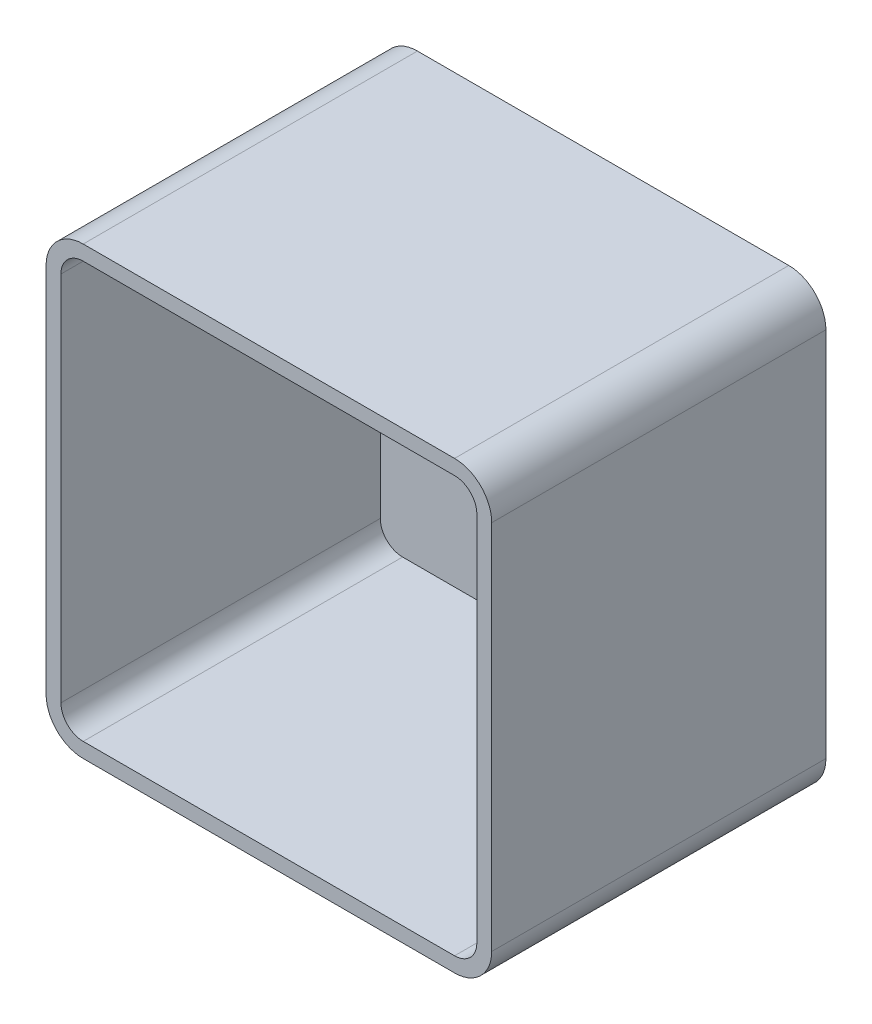
ISO-10303-21;
HEADER;
FILE_DESCRIPTION(('STEP AP214'),'2;1');
FILE_NAME('part.step','',(''),(''),'','','');
FILE_SCHEMA(('AUTOMOTIVE_DESIGN { 1 0 10303 214 1 1 1 1 }'));
ENDSEC;
DATA;
#1=APPLICATION_CONTEXT('core data for automotive mechanical design processes');
#2=APPLICATION_PROTOCOL_DEFINITION('international standard','automotive_design',2000,#1);
#3=PRODUCT_CONTEXT('',#1,'mechanical');
#4=PRODUCT('Part','Part','',(#3));
#5=PRODUCT_RELATED_PRODUCT_CATEGORY('part','',(#4));
#6=PRODUCT_DEFINITION_FORMATION('','',#4);
#7=PRODUCT_DEFINITION_CONTEXT('part definition',#1,'design');
#8=PRODUCT_DEFINITION('design','',#6,#7);
#9=PRODUCT_DEFINITION_SHAPE('','',#8);
#10=(LENGTH_UNIT() NAMED_UNIT(*) SI_UNIT(.MILLI.,.METRE.));
#11=(NAMED_UNIT(*) PLANE_ANGLE_UNIT() SI_UNIT($,.RADIAN.));
#12=(NAMED_UNIT(*) SI_UNIT($,.STERADIAN.) SOLID_ANGLE_UNIT());
#13=UNCERTAINTY_MEASURE_WITH_UNIT(LENGTH_MEASURE(1.E-05),#10,'distance_accuracy_value','');
#14=(GEOMETRIC_REPRESENTATION_CONTEXT(3) GLOBAL_UNCERTAINTY_ASSIGNED_CONTEXT((#13)) GLOBAL_UNIT_ASSIGNED_CONTEXT((#10,
#11,#12)) REPRESENTATION_CONTEXT('',''));
#15=CARTESIAN_POINT('',(0.,0.,0.));
#16=DIRECTION('',(0.,0.,1.));
#17=DIRECTION('',(1.,0.,0.));
#18=AXIS2_PLACEMENT_3D('',#15,#16,#17);
#19=CARTESIAN_POINT('',(0.,0.,90.));
#20=DIRECTION('',(1.,0.,0.));
#21=DIRECTION('',(0.,0.,-1.));
#22=AXIS2_PLACEMENT_3D('',#19,#20,#21);
#23=PLANE('',#22);
#24=DIRECTION('',(0.,-1.,0.));
#25=VECTOR('',#24,1.);
#26=CARTESIAN_POINT('',(0.,0.,0.));
#27=LINE('',#26,#25);
#28=CARTESIAN_POINT('',(0.,110.,0.));
#29=VERTEX_POINT('',#28);
#30=CARTESIAN_POINT('',(0.,10.,0.));
#31=VERTEX_POINT('',#30);
#32=EDGE_CURVE('E228',#29,#31,#27,.T.);
#33=ORIENTED_EDGE('',*,*,#32,.T.);
#34=DIRECTION('',(0.,0.,-1.));
#35=VECTOR('',#34,1.);
#36=CARTESIAN_POINT('',(0.,10.,90.));
#37=LINE('',#36,#35);
#38=CARTESIAN_POINT('',(0.,10.,90.));
#39=VERTEX_POINT('',#38);
#40=EDGE_CURVE('E302',#31,#39,#37,.F.);
#41=ORIENTED_EDGE('',*,*,#40,.T.);
#42=DIRECTION('',(0.,-1.,0.));
#43=VECTOR('',#42,1.);
#44=CARTESIAN_POINT('',(0.,0.,90.));
#45=LINE('',#44,#43);
#46=CARTESIAN_POINT('',(0.,110.,90.));
#47=VERTEX_POINT('',#46);
#48=EDGE_CURVE('E250',#47,#39,#45,.T.);
#49=ORIENTED_EDGE('',*,*,#48,.F.);
#50=DIRECTION('',(0.,0.,-1.));
#51=VECTOR('',#50,1.);
#52=CARTESIAN_POINT('',(0.,110.,90.));
#53=LINE('',#52,#51);
#54=EDGE_CURVE('E298',#47,#29,#53,.T.);
#55=ORIENTED_EDGE('',*,*,#54,.T.);
#56=EDGE_LOOP('',(#33,#41,#49,#55));
#57=FACE_BOUND('',#56,.T.);
#58=ADVANCED_FACE('F39',(#57),#23,.F.);
#59=CARTESIAN_POINT('',(0.,0.,90.));
#60=DIRECTION('',(0.,1.,0.));
#61=DIRECTION('',(0.,0.,1.));
#62=AXIS2_PLACEMENT_3D('',#59,#60,#61);
#63=PLANE('',#62);
#64=DIRECTION('',(1.,0.,0.));
#65=VECTOR('',#64,1.);
#66=CARTESIAN_POINT('',(0.,0.,90.));
#67=LINE('',#66,#65);
#68=CARTESIAN_POINT('',(10.,0.,90.));
#69=VERTEX_POINT('',#68);
#70=CARTESIAN_POINT('',(110.,0.,90.));
#71=VERTEX_POINT('',#70);
#72=EDGE_CURVE('E254',#69,#71,#67,.T.);
#73=ORIENTED_EDGE('',*,*,#72,.F.);
#74=DIRECTION('',(0.,0.,-1.));
#75=VECTOR('',#74,1.);
#76=CARTESIAN_POINT('',(10.,0.,90.));
#77=LINE('',#76,#75);
#78=CARTESIAN_POINT('',(10.,0.,0.));
#79=VERTEX_POINT('',#78);
#80=EDGE_CURVE('E282',#69,#79,#77,.T.);
#81=ORIENTED_EDGE('',*,*,#80,.T.);
#82=DIRECTION('',(1.,0.,0.));
#83=VECTOR('',#82,1.);
#84=CARTESIAN_POINT('',(0.,0.,0.));
#85=LINE('',#84,#83);
#86=CARTESIAN_POINT('',(110.,0.,0.));
#87=VERTEX_POINT('',#86);
#88=EDGE_CURVE('E270',#79,#87,#85,.T.);
#89=ORIENTED_EDGE('',*,*,#88,.T.);
#90=DIRECTION('',(0.,0.,-1.));
#91=VECTOR('',#90,1.);
#92=CARTESIAN_POINT('',(110.,0.,90.));
#93=LINE('',#92,#91);
#94=EDGE_CURVE('E266',#87,#71,#93,.F.);
#95=ORIENTED_EDGE('',*,*,#94,.T.);
#96=EDGE_LOOP('',(#73,#81,#89,#95));
#97=FACE_BOUND('',#96,.T.);
#98=ADVANCED_FACE('F356',(#97),#63,.F.);
#99=CARTESIAN_POINT('',(120.,0.,90.));
#100=DIRECTION('',(-1.,0.,0.));
#101=DIRECTION('',(0.,0.,1.));
#102=AXIS2_PLACEMENT_3D('',#99,#100,#101);
#103=PLANE('',#102);
#104=DIRECTION('',(0.,1.,0.));
#105=VECTOR('',#104,1.);
#106=CARTESIAN_POINT('',(120.,0.,90.));
#107=LINE('',#106,#105);
#108=CARTESIAN_POINT('',(120.,10.,90.));
#109=VERTEX_POINT('',#108);
#110=CARTESIAN_POINT('',(120.,110.,90.));
#111=VERTEX_POINT('',#110);
#112=EDGE_CURVE('E259',#109,#111,#107,.T.);
#113=ORIENTED_EDGE('',*,*,#112,.F.);
#114=DIRECTION('',(0.,0.,-1.));
#115=VECTOR('',#114,1.);
#116=CARTESIAN_POINT('',(120.,10.,90.));
#117=LINE('',#116,#115);
#118=CARTESIAN_POINT('',(120.,10.,0.));
#119=VERTEX_POINT('',#118);
#120=EDGE_CURVE('E320',#109,#119,#117,.T.);
#121=ORIENTED_EDGE('',*,*,#120,.T.);
#122=DIRECTION('',(0.,1.,0.));
#123=VECTOR('',#122,1.);
#124=CARTESIAN_POINT('',(120.,0.,0.));
#125=LINE('',#124,#123);
#126=CARTESIAN_POINT('',(120.,110.,0.));
#127=VERTEX_POINT('',#126);
#128=EDGE_CURVE('E274',#119,#127,#125,.T.);
#129=ORIENTED_EDGE('',*,*,#128,.T.);
#130=DIRECTION('',(0.,0.,-1.));
#131=VECTOR('',#130,1.);
#132=CARTESIAN_POINT('',(120.,110.,90.));
#133=LINE('',#132,#131);
#134=EDGE_CURVE('E317',#127,#111,#133,.F.);
#135=ORIENTED_EDGE('',*,*,#134,.T.);
#136=EDGE_LOOP('',(#113,#121,#129,#135));
#137=FACE_BOUND('',#136,.T.);
#138=ADVANCED_FACE('F328',(#137),#103,.F.);
#139=CARTESIAN_POINT('',(0.,120.,90.));
#140=DIRECTION('',(0.,-1.,0.));
#141=DIRECTION('',(0.,0.,-1.));
#142=AXIS2_PLACEMENT_3D('',#139,#140,#141);
#143=PLANE('',#142);
#144=DIRECTION('',(-1.,0.,0.));
#145=VECTOR('',#144,1.);
#146=CARTESIAN_POINT('',(0.,120.,90.));
#147=LINE('',#146,#145);
#148=CARTESIAN_POINT('',(110.,120.,90.));
#149=VERTEX_POINT('',#148);
#150=CARTESIAN_POINT('',(10.,120.,90.));
#151=VERTEX_POINT('',#150);
#152=EDGE_CURVE('E263',#149,#151,#147,.T.);
#153=ORIENTED_EDGE('',*,*,#152,.F.);
#154=DIRECTION('',(0.,0.,-1.));
#155=VECTOR('',#154,1.);
#156=CARTESIAN_POINT('',(110.,120.,90.));
#157=LINE('',#156,#155);
#158=CARTESIAN_POINT('',(110.,120.,0.));
#159=VERTEX_POINT('',#158);
#160=EDGE_CURVE('E11',#149,#159,#157,.T.);
#161=ORIENTED_EDGE('',*,*,#160,.T.);
#162=DIRECTION('',(-1.,0.,0.));
#163=VECTOR('',#162,1.);
#164=CARTESIAN_POINT('',(0.,120.,0.));
#165=LINE('',#164,#163);
#166=CARTESIAN_POINT('',(10.,120.,0.));
#167=VERTEX_POINT('',#166);
#168=EDGE_CURVE('E255',#159,#167,#165,.T.);
#169=ORIENTED_EDGE('',*,*,#168,.T.);
#170=DIRECTION('',(0.,0.,-1.));
#171=VECTOR('',#170,1.);
#172=CARTESIAN_POINT('',(10.,120.,90.));
#173=LINE('',#172,#171);
#174=EDGE_CURVE('E48',#167,#151,#173,.F.);
#175=ORIENTED_EDGE('',*,*,#174,.T.);
#176=EDGE_LOOP('',(#153,#161,#169,#175));
#177=FACE_BOUND('',#176,.T.);
#178=ADVANCED_FACE('F340',(#177),#143,.F.);
#179=CARTESIAN_POINT('',(0.,0.,90.));
#180=DIRECTION('',(0.,0.,-1.));
#181=DIRECTION('',(-1.,0.,0.));
#182=AXIS2_PLACEMENT_3D('',#179,#180,#181);
#183=PLANE('',#182);
#184=DIRECTION('',(0.,-1.,0.));
#185=VECTOR('',#184,1.);
#186=CARTESIAN_POINT('',(4.,0.,90.));
#187=LINE('',#186,#185);
#188=CARTESIAN_POINT('',(4.,110.,90.));
#189=VERTEX_POINT('',#188);
#190=CARTESIAN_POINT('',(4.,9.99999999999999,90.));
#191=VERTEX_POINT('',#190);
#192=EDGE_CURVE('E183',#189,#191,#187,.T.);
#193=ORIENTED_EDGE('',*,*,#192,.F.);
#194=CARTESIAN_POINT('',(10.,110.,90.));
#195=DIRECTION('',(0.,0.,-1.));
#196=DIRECTION('',(-1.,0.,0.));
#197=AXIS2_PLACEMENT_3D('',#194,#195,#196);
#198=CIRCLE('',#197,6.);
#199=CARTESIAN_POINT('',(9.99999999999999,116.,90.));
#200=VERTEX_POINT('',#199);
#201=EDGE_CURVE('E186',#200,#189,#198,.F.);
#202=ORIENTED_EDGE('',*,*,#201,.F.);
#203=DIRECTION('',(-1.,0.,0.));
#204=VECTOR('',#203,1.);
#205=CARTESIAN_POINT('',(0.,116.,90.));
#206=LINE('',#205,#204);
#207=CARTESIAN_POINT('',(110.,116.,90.));
#208=VERTEX_POINT('',#207);
#209=EDGE_CURVE('E55',#208,#200,#206,.T.);
#210=ORIENTED_EDGE('',*,*,#209,.F.);
#211=CARTESIAN_POINT('',(110.,110.,90.));
#212=DIRECTION('',(0.,0.,-1.));
#213=DIRECTION('',(-1.,0.,0.));
#214=AXIS2_PLACEMENT_3D('',#211,#212,#213);
#215=CIRCLE('',#214,6.);
#216=CARTESIAN_POINT('',(116.,110.,90.));
#217=VERTEX_POINT('',#216);
#218=EDGE_CURVE('E190',#217,#208,#215,.F.);
#219=ORIENTED_EDGE('',*,*,#218,.F.);
#220=DIRECTION('',(0.,1.,0.));
#221=VECTOR('',#220,1.);
#222=CARTESIAN_POINT('',(116.,0.,90.));
#223=LINE('',#222,#221);
#224=CARTESIAN_POINT('',(116.,9.99999999999999,90.));
#225=VERTEX_POINT('',#224);
#226=EDGE_CURVE('E240',#225,#217,#223,.T.);
#227=ORIENTED_EDGE('',*,*,#226,.F.);
#228=CARTESIAN_POINT('',(110.,10.,90.));
#229=DIRECTION('',(0.,0.,-1.));
#230=DIRECTION('',(-1.,0.,0.));
#231=AXIS2_PLACEMENT_3D('',#228,#229,#230);
#232=CIRCLE('',#231,6.);
#233=CARTESIAN_POINT('',(110.,4.,90.));
#234=VERTEX_POINT('',#233);
#235=EDGE_CURVE('E236',#234,#225,#232,.F.);
#236=ORIENTED_EDGE('',*,*,#235,.F.);
#237=DIRECTION('',(1.,0.,0.));
#238=VECTOR('',#237,1.);
#239=CARTESIAN_POINT('',(0.,4.,90.));
#240=LINE('',#239,#238);
#241=CARTESIAN_POINT('',(9.99999999999999,4.,90.));
#242=VERTEX_POINT('',#241);
#243=EDGE_CURVE('E233',#242,#234,#240,.T.);
#244=ORIENTED_EDGE('',*,*,#243,.F.);
#245=CARTESIAN_POINT('',(10.,10.,90.));
#246=DIRECTION('',(0.,0.,-1.));
#247=DIRECTION('',(-1.,0.,0.));
#248=AXIS2_PLACEMENT_3D('',#245,#246,#247);
#249=CIRCLE('',#248,6.);
#250=EDGE_CURVE('E223',#191,#242,#249,.F.);
#251=ORIENTED_EDGE('',*,*,#250,.F.);
#252=EDGE_LOOP('',(#193,#202,#210,#219,#227,#236,#244,#251));
#253=FACE_BOUND('',#252,.T.);
#254=ORIENTED_EDGE('',*,*,#48,.T.);
#255=CARTESIAN_POINT('',(10.,10.,90.));
#256=DIRECTION('',(0.,0.,-1.));
#257=DIRECTION('',(-1.,0.,0.));
#258=AXIS2_PLACEMENT_3D('',#255,#256,#257);
#259=CIRCLE('',#258,10.);
#260=EDGE_CURVE('E314',#39,#69,#259,.F.);
#261=ORIENTED_EDGE('',*,*,#260,.T.);
#262=ORIENTED_EDGE('',*,*,#72,.T.);
#263=CARTESIAN_POINT('',(110.,10.,90.));
#264=DIRECTION('',(0.,0.,-1.));
#265=DIRECTION('',(-1.,0.,0.));
#266=AXIS2_PLACEMENT_3D('',#263,#264,#265);
#267=CIRCLE('',#266,10.);
#268=EDGE_CURVE('E311',#71,#109,#267,.F.);
#269=ORIENTED_EDGE('',*,*,#268,.T.);
#270=ORIENTED_EDGE('',*,*,#112,.T.);
#271=CARTESIAN_POINT('',(110.,110.,90.));
#272=DIRECTION('',(0.,0.,-1.));
#273=DIRECTION('',(-1.,0.,0.));
#274=AXIS2_PLACEMENT_3D('',#271,#272,#273);
#275=CIRCLE('',#274,10.);
#276=EDGE_CURVE('E308',#111,#149,#275,.F.);
#277=ORIENTED_EDGE('',*,*,#276,.T.);
#278=ORIENTED_EDGE('',*,*,#152,.T.);
#279=CARTESIAN_POINT('',(10.,110.,90.));
#280=DIRECTION('',(0.,0.,-1.));
#281=DIRECTION('',(-1.,0.,0.));
#282=AXIS2_PLACEMENT_3D('',#279,#280,#281);
#283=CIRCLE('',#282,10.);
#284=EDGE_CURVE('E305',#151,#47,#283,.F.);
#285=ORIENTED_EDGE('',*,*,#284,.T.);
#286=EDGE_LOOP('',(#254,#261,#262,#269,#270,#277,#278,#285));
#287=FACE_BOUND('',#286,.T.);
#288=ADVANCED_FACE('F343',(#253,#287),#183,.F.);
#289=CARTESIAN_POINT('',(0.,0.,0.));
#290=DIRECTION('',(0.,0.,-1.));
#291=DIRECTION('',(-1.,0.,0.));
#292=AXIS2_PLACEMENT_3D('',#289,#290,#291);
#293=PLANE('',#292);
#294=ORIENTED_EDGE('',*,*,#88,.F.);
#295=CARTESIAN_POINT('',(10.,10.,0.));
#296=DIRECTION('',(0.,0.,-1.));
#297=DIRECTION('',(-1.,0.,0.));
#298=AXIS2_PLACEMENT_3D('',#295,#296,#297);
#299=CIRCLE('',#298,10.);
#300=EDGE_CURVE('E295',#79,#31,#299,.T.);
#301=ORIENTED_EDGE('',*,*,#300,.T.);
#302=ORIENTED_EDGE('',*,*,#32,.F.);
#303=CARTESIAN_POINT('',(10.,110.,0.));
#304=DIRECTION('',(0.,0.,-1.));
#305=DIRECTION('',(-1.,0.,0.));
#306=AXIS2_PLACEMENT_3D('',#303,#304,#305);
#307=CIRCLE('',#306,10.);
#308=EDGE_CURVE('E286',#29,#167,#307,.T.);
#309=ORIENTED_EDGE('',*,*,#308,.T.);
#310=ORIENTED_EDGE('',*,*,#168,.F.);
#311=CARTESIAN_POINT('',(110.,110.,0.));
#312=DIRECTION('',(0.,0.,-1.));
#313=DIRECTION('',(-1.,0.,0.));
#314=AXIS2_PLACEMENT_3D('',#311,#312,#313);
#315=CIRCLE('',#314,10.);
#316=EDGE_CURVE('E289',#159,#127,#315,.T.);
#317=ORIENTED_EDGE('',*,*,#316,.T.);
#318=ORIENTED_EDGE('',*,*,#128,.F.);
#319=CARTESIAN_POINT('',(110.,10.,0.));
#320=DIRECTION('',(0.,0.,-1.));
#321=DIRECTION('',(-1.,0.,0.));
#322=AXIS2_PLACEMENT_3D('',#319,#320,#321);
#323=CIRCLE('',#322,10.);
#324=EDGE_CURVE('E292',#119,#87,#323,.T.);
#325=ORIENTED_EDGE('',*,*,#324,.T.);
#326=EDGE_LOOP('',(#294,#301,#302,#309,#310,#317,#318,#325));
#327=FACE_BOUND('',#326,.T.);
#328=ADVANCED_FACE('F334',(#327),#293,.T.);
#329=CARTESIAN_POINT('',(10.,10.,90.));
#330=DIRECTION('',(0.,0.,-1.));
#331=DIRECTION('',(-1.,0.,0.));
#332=AXIS2_PLACEMENT_3D('',#329,#330,#331);
#333=CYLINDRICAL_SURFACE('',#332,10.);
#334=ORIENTED_EDGE('',*,*,#260,.F.);
#335=ORIENTED_EDGE('',*,*,#40,.F.);
#336=ORIENTED_EDGE('',*,*,#300,.F.);
#337=ORIENTED_EDGE('',*,*,#80,.F.);
#338=EDGE_LOOP('',(#334,#335,#336,#337));
#339=FACE_BOUND('',#338,.T.);
#340=ADVANCED_FACE('F353',(#339),#333,.T.);
#341=CARTESIAN_POINT('',(110.,10.,90.));
#342=DIRECTION('',(0.,0.,-1.));
#343=DIRECTION('',(-1.,0.,0.));
#344=AXIS2_PLACEMENT_3D('',#341,#342,#343);
#345=CYLINDRICAL_SURFACE('',#344,10.);
#346=ORIENTED_EDGE('',*,*,#268,.F.);
#347=ORIENTED_EDGE('',*,*,#94,.F.);
#348=ORIENTED_EDGE('',*,*,#324,.F.);
#349=ORIENTED_EDGE('',*,*,#120,.F.);
#350=EDGE_LOOP('',(#346,#347,#348,#349));
#351=FACE_BOUND('',#350,.T.);
#352=ADVANCED_FACE('F358',(#351),#345,.T.);
#353=CARTESIAN_POINT('',(110.,110.,90.));
#354=DIRECTION('',(0.,0.,-1.));
#355=DIRECTION('',(-1.,0.,0.));
#356=AXIS2_PLACEMENT_3D('',#353,#354,#355);
#357=CYLINDRICAL_SURFACE('',#356,10.);
#358=ORIENTED_EDGE('',*,*,#276,.F.);
#359=ORIENTED_EDGE('',*,*,#134,.F.);
#360=ORIENTED_EDGE('',*,*,#316,.F.);
#361=ORIENTED_EDGE('',*,*,#160,.F.);
#362=EDGE_LOOP('',(#358,#359,#360,#361));
#363=FACE_BOUND('',#362,.T.);
#364=ADVANCED_FACE('F339',(#363),#357,.T.);
#365=CARTESIAN_POINT('',(10.,110.,90.));
#366=DIRECTION('',(0.,0.,-1.));
#367=DIRECTION('',(-1.,0.,0.));
#368=AXIS2_PLACEMENT_3D('',#365,#366,#367);
#369=CYLINDRICAL_SURFACE('',#368,10.);
#370=ORIENTED_EDGE('',*,*,#284,.F.);
#371=ORIENTED_EDGE('',*,*,#174,.F.);
#372=ORIENTED_EDGE('',*,*,#308,.F.);
#373=ORIENTED_EDGE('',*,*,#54,.F.);
#374=EDGE_LOOP('',(#370,#371,#372,#373));
#375=FACE_BOUND('',#374,.T.);
#376=ADVANCED_FACE('F41',(#375),#369,.T.);
#377=CARTESIAN_POINT('',(4.,0.,90.));
#378=DIRECTION('',(1.,0.,0.));
#379=DIRECTION('',(0.,0.,-1.));
#380=AXIS2_PLACEMENT_3D('',#377,#378,#379);
#381=PLANE('',#380);
#382=DIRECTION('',(0.,-1.,0.));
#383=VECTOR('',#382,1.);
#384=CARTESIAN_POINT('',(4.,0.,4.));
#385=LINE('',#384,#383);
#386=CARTESIAN_POINT('',(4.,110.,4.));
#387=VERTEX_POINT('',#386);
#388=CARTESIAN_POINT('',(4.,9.99999999999999,4.));
#389=VERTEX_POINT('',#388);
#390=EDGE_CURVE('E171',#387,#389,#385,.T.);
#391=ORIENTED_EDGE('',*,*,#390,.F.);
#392=DIRECTION('',(0.,0.,-1.));
#393=VECTOR('',#392,1.);
#394=CARTESIAN_POINT('',(4.,110.,90.));
#395=LINE('',#394,#393);
#396=EDGE_CURVE('E167',#189,#387,#395,.T.);
#397=ORIENTED_EDGE('',*,*,#396,.F.);
#398=ORIENTED_EDGE('',*,*,#192,.T.);
#399=DIRECTION('',(0.,0.,-1.));
#400=VECTOR('',#399,1.);
#401=CARTESIAN_POINT('',(4.,9.99999999999999,90.));
#402=LINE('',#401,#400);
#403=EDGE_CURVE('E159',#389,#191,#402,.F.);
#404=ORIENTED_EDGE('',*,*,#403,.F.);
#405=EDGE_LOOP('',(#391,#397,#398,#404));
#406=FACE_BOUND('',#405,.T.);
#407=ADVANCED_FACE('F181',(#406),#381,.T.);
#408=CARTESIAN_POINT('',(0.,4.,90.));
#409=DIRECTION('',(0.,1.,0.));
#410=DIRECTION('',(0.,0.,1.));
#411=AXIS2_PLACEMENT_3D('',#408,#409,#410);
#412=PLANE('',#411);
#413=ORIENTED_EDGE('',*,*,#243,.T.);
#414=DIRECTION('',(0.,0.,1.));
#415=VECTOR('',#414,1.);
#416=CARTESIAN_POINT('',(110.,4.,90.));
#417=LINE('',#416,#415);
#418=CARTESIAN_POINT('',(110.,4.,4.));
#419=VERTEX_POINT('',#418);
#420=EDGE_CURVE('E212',#419,#234,#417,.T.);
#421=ORIENTED_EDGE('',*,*,#420,.F.);
#422=DIRECTION('',(1.,0.,0.));
#423=VECTOR('',#422,1.);
#424=CARTESIAN_POINT('',(0.,4.,4.));
#425=LINE('',#424,#423);
#426=CARTESIAN_POINT('',(9.99999999999999,4.,4.));
#427=VERTEX_POINT('',#426);
#428=EDGE_CURVE('E179',#427,#419,#425,.T.);
#429=ORIENTED_EDGE('',*,*,#428,.F.);
#430=DIRECTION('',(0.,0.,1.));
#431=VECTOR('',#430,1.);
#432=CARTESIAN_POINT('',(9.99999999999999,4.,90.));
#433=LINE('',#432,#431);
#434=EDGE_CURVE('E162',#242,#427,#433,.F.);
#435=ORIENTED_EDGE('',*,*,#434,.F.);
#436=EDGE_LOOP('',(#413,#421,#429,#435));
#437=FACE_BOUND('',#436,.T.);
#438=ADVANCED_FACE('F404',(#437),#412,.T.);
#439=CARTESIAN_POINT('',(116.,0.,90.));
#440=DIRECTION('',(-1.,0.,0.));
#441=DIRECTION('',(0.,0.,1.));
#442=AXIS2_PLACEMENT_3D('',#439,#440,#441);
#443=PLANE('',#442);
#444=ORIENTED_EDGE('',*,*,#226,.T.);
#445=DIRECTION('',(0.,0.,1.));
#446=VECTOR('',#445,1.);
#447=CARTESIAN_POINT('',(116.,110.,90.));
#448=LINE('',#447,#446);
#449=CARTESIAN_POINT('',(116.,110.,4.));
#450=VERTEX_POINT('',#449);
#451=EDGE_CURVE('E220',#450,#217,#448,.T.);
#452=ORIENTED_EDGE('',*,*,#451,.F.);
#453=DIRECTION('',(0.,1.,0.));
#454=VECTOR('',#453,1.);
#455=CARTESIAN_POINT('',(116.,0.,4.));
#456=LINE('',#455,#454);
#457=CARTESIAN_POINT('',(116.,9.99999999999999,4.));
#458=VERTEX_POINT('',#457);
#459=EDGE_CURVE('E195',#458,#450,#456,.T.);
#460=ORIENTED_EDGE('',*,*,#459,.F.);
#461=DIRECTION('',(0.,0.,1.));
#462=VECTOR('',#461,1.);
#463=CARTESIAN_POINT('',(116.,9.99999999999999,90.));
#464=LINE('',#463,#462);
#465=EDGE_CURVE('E215',#225,#458,#464,.F.);
#466=ORIENTED_EDGE('',*,*,#465,.F.);
#467=EDGE_LOOP('',(#444,#452,#460,#466));
#468=FACE_BOUND('',#467,.T.);
#469=ADVANCED_FACE('F401',(#468),#443,.T.);
#470=CARTESIAN_POINT('',(0.,116.,90.));
#471=DIRECTION('',(0.,-1.,0.));
#472=DIRECTION('',(0.,0.,-1.));
#473=AXIS2_PLACEMENT_3D('',#470,#471,#472);
#474=PLANE('',#473);
#475=ORIENTED_EDGE('',*,*,#209,.T.);
#476=DIRECTION('',(0.,0.,-1.));
#477=VECTOR('',#476,1.);
#478=CARTESIAN_POINT('',(9.99999999999999,116.,90.));
#479=LINE('',#478,#477);
#480=CARTESIAN_POINT('',(9.99999999999999,116.,4.));
#481=VERTEX_POINT('',#480);
#482=EDGE_CURVE('E219',#481,#200,#479,.F.);
#483=ORIENTED_EDGE('',*,*,#482,.F.);
#484=DIRECTION('',(-1.,0.,0.));
#485=VECTOR('',#484,1.);
#486=CARTESIAN_POINT('',(0.,116.,4.));
#487=LINE('',#486,#485);
#488=CARTESIAN_POINT('',(110.,116.,4.));
#489=VERTEX_POINT('',#488);
#490=EDGE_CURVE('E200',#489,#481,#487,.T.);
#491=ORIENTED_EDGE('',*,*,#490,.F.);
#492=DIRECTION('',(0.,0.,-1.));
#493=VECTOR('',#492,1.);
#494=CARTESIAN_POINT('',(110.,116.,90.));
#495=LINE('',#494,#493);
#496=EDGE_CURVE('E224',#208,#489,#495,.T.);
#497=ORIENTED_EDGE('',*,*,#496,.F.);
#498=EDGE_LOOP('',(#475,#483,#491,#497));
#499=FACE_BOUND('',#498,.T.);
#500=ADVANCED_FACE('F398',(#499),#474,.T.);
#501=CARTESIAN_POINT('',(0.,0.,4.));
#502=DIRECTION('',(0.,0.,-1.));
#503=DIRECTION('',(-1.,0.,0.));
#504=AXIS2_PLACEMENT_3D('',#501,#502,#503);
#505=PLANE('',#504);
#506=ORIENTED_EDGE('',*,*,#428,.T.);
#507=CARTESIAN_POINT('',(110.,10.,4.));
#508=DIRECTION('',(0.,0.,-1.));
#509=DIRECTION('',(-1.,0.,0.));
#510=AXIS2_PLACEMENT_3D('',#507,#508,#509);
#511=CIRCLE('',#510,6.);
#512=EDGE_CURVE('E168',#458,#419,#511,.T.);
#513=ORIENTED_EDGE('',*,*,#512,.F.);
#514=ORIENTED_EDGE('',*,*,#459,.T.);
#515=CARTESIAN_POINT('',(110.,110.,4.));
#516=DIRECTION('',(0.,0.,-1.));
#517=DIRECTION('',(-1.,0.,0.));
#518=AXIS2_PLACEMENT_3D('',#515,#516,#517);
#519=CIRCLE('',#518,6.);
#520=EDGE_CURVE('E199',#489,#450,#519,.T.);
#521=ORIENTED_EDGE('',*,*,#520,.F.);
#522=ORIENTED_EDGE('',*,*,#490,.T.);
#523=CARTESIAN_POINT('',(10.,110.,4.));
#524=DIRECTION('',(0.,0.,-1.));
#525=DIRECTION('',(-1.,0.,0.));
#526=AXIS2_PLACEMENT_3D('',#523,#524,#525);
#527=CIRCLE('',#526,6.);
#528=EDGE_CURVE('E174',#387,#481,#527,.T.);
#529=ORIENTED_EDGE('',*,*,#528,.F.);
#530=ORIENTED_EDGE('',*,*,#390,.T.);
#531=CARTESIAN_POINT('',(10.,10.,4.));
#532=DIRECTION('',(0.,0.,-1.));
#533=DIRECTION('',(-1.,0.,0.));
#534=AXIS2_PLACEMENT_3D('',#531,#532,#533);
#535=CIRCLE('',#534,6.);
#536=EDGE_CURVE('E155',#427,#389,#535,.T.);
#537=ORIENTED_EDGE('',*,*,#536,.F.);
#538=EDGE_LOOP('',(#506,#513,#514,#521,#522,#529,#530,#537));
#539=FACE_BOUND('',#538,.T.);
#540=ADVANCED_FACE('F172',(#539),#505,.F.);
#541=CARTESIAN_POINT('',(10.,10.,90.));
#542=DIRECTION('',(0.,0.,-1.));
#543=DIRECTION('',(-1.,0.,0.));
#544=AXIS2_PLACEMENT_3D('',#541,#542,#543);
#545=CYLINDRICAL_SURFACE('',#544,6.);
#546=ORIENTED_EDGE('',*,*,#250,.T.);
#547=ORIENTED_EDGE('',*,*,#434,.T.);
#548=ORIENTED_EDGE('',*,*,#536,.T.);
#549=ORIENTED_EDGE('',*,*,#403,.T.);
#550=EDGE_LOOP('',(#546,#547,#548,#549));
#551=FACE_BOUND('',#550,.T.);
#552=ADVANCED_FACE('F157',(#551),#545,.F.);
#553=CARTESIAN_POINT('',(110.,10.,90.));
#554=DIRECTION('',(0.,0.,-1.));
#555=DIRECTION('',(-1.,0.,0.));
#556=AXIS2_PLACEMENT_3D('',#553,#554,#555);
#557=CYLINDRICAL_SURFACE('',#556,6.);
#558=ORIENTED_EDGE('',*,*,#235,.T.);
#559=ORIENTED_EDGE('',*,*,#465,.T.);
#560=ORIENTED_EDGE('',*,*,#512,.T.);
#561=ORIENTED_EDGE('',*,*,#420,.T.);
#562=EDGE_LOOP('',(#558,#559,#560,#561));
#563=FACE_BOUND('',#562,.T.);
#564=ADVANCED_FACE('F389',(#563),#557,.F.);
#565=CARTESIAN_POINT('',(110.,110.,90.));
#566=DIRECTION('',(0.,0.,-1.));
#567=DIRECTION('',(-1.,0.,0.));
#568=AXIS2_PLACEMENT_3D('',#565,#566,#567);
#569=CYLINDRICAL_SURFACE('',#568,6.);
#570=ORIENTED_EDGE('',*,*,#218,.T.);
#571=ORIENTED_EDGE('',*,*,#496,.T.);
#572=ORIENTED_EDGE('',*,*,#520,.T.);
#573=ORIENTED_EDGE('',*,*,#451,.T.);
#574=EDGE_LOOP('',(#570,#571,#572,#573));
#575=FACE_BOUND('',#574,.T.);
#576=ADVANCED_FACE('F385',(#575),#569,.F.);
#577=CARTESIAN_POINT('',(10.,110.,90.));
#578=DIRECTION('',(0.,0.,-1.));
#579=DIRECTION('',(-1.,0.,0.));
#580=AXIS2_PLACEMENT_3D('',#577,#578,#579);
#581=CYLINDRICAL_SURFACE('',#580,6.);
#582=ORIENTED_EDGE('',*,*,#201,.T.);
#583=ORIENTED_EDGE('',*,*,#396,.T.);
#584=ORIENTED_EDGE('',*,*,#528,.T.);
#585=ORIENTED_EDGE('',*,*,#482,.T.);
#586=EDGE_LOOP('',(#582,#583,#584,#585));
#587=FACE_BOUND('',#586,.T.);
#588=ADVANCED_FACE('F382',(#587),#581,.F.);
#589=CLOSED_SHELL('',(#58,#98,#138,#178,#288,#328,#340,#352,#364,#376,#407,#438,#469,#500,#540,
#552,#564,#576,#588));
#590=MANIFOLD_SOLID_BREP('B2',#589);
#591=ADVANCED_BREP_SHAPE_REPRESENTATION('',(#18,#590),#14);
#592=SHAPE_DEFINITION_REPRESENTATION(#9,#591);
ENDSEC;
END-ISO-10303-21;
